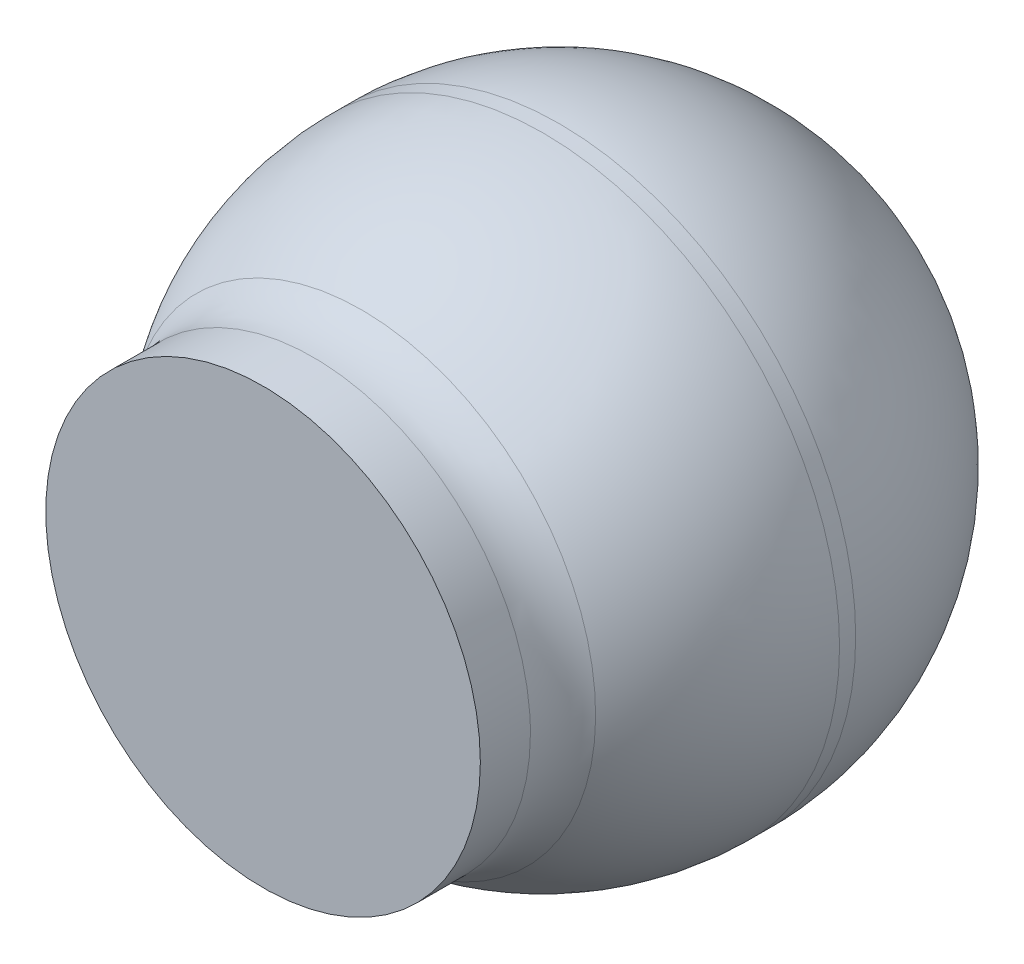
ISO-10303-21;
HEADER;
FILE_DESCRIPTION(('STEP AP214'),'2;1');
FILE_NAME('part.step','',(''),(''),'','','');
FILE_SCHEMA(('AUTOMOTIVE_DESIGN { 1 0 10303 214 1 1 1 1 }'));
ENDSEC;
DATA;
#1=APPLICATION_CONTEXT('core data for automotive mechanical design processes');
#2=APPLICATION_PROTOCOL_DEFINITION('international standard','automotive_design',2000,#1);
#3=PRODUCT_CONTEXT('',#1,'mechanical');
#4=PRODUCT('Part','Part','',(#3));
#5=PRODUCT_RELATED_PRODUCT_CATEGORY('part','',(#4));
#6=PRODUCT_DEFINITION_FORMATION('','',#4);
#7=PRODUCT_DEFINITION_CONTEXT('part definition',#1,'design');
#8=PRODUCT_DEFINITION('design','',#6,#7);
#9=PRODUCT_DEFINITION_SHAPE('','',#8);
#10=(LENGTH_UNIT() NAMED_UNIT(*) SI_UNIT(.MILLI.,.METRE.));
#11=(NAMED_UNIT(*) PLANE_ANGLE_UNIT() SI_UNIT($,.RADIAN.));
#12=(NAMED_UNIT(*) SI_UNIT($,.STERADIAN.) SOLID_ANGLE_UNIT());
#13=UNCERTAINTY_MEASURE_WITH_UNIT(LENGTH_MEASURE(1.E-05),#10,'distance_accuracy_value','');
#14=(GEOMETRIC_REPRESENTATION_CONTEXT(3) GLOBAL_UNCERTAINTY_ASSIGNED_CONTEXT((#13)) GLOBAL_UNIT_ASSIGNED_CONTEXT((#10,
#11,#12)) REPRESENTATION_CONTEXT('',''));
#15=CARTESIAN_POINT('',(0.,0.,0.));
#16=DIRECTION('',(0.,0.,1.));
#17=DIRECTION('',(1.,0.,0.));
#18=AXIS2_PLACEMENT_3D('',#15,#16,#17);
#19=CARTESIAN_POINT('',(-5.642919922269,-11.67134929145,10.006534503384));
#20=DIRECTION('',(0.,0.,-1.));
#21=DIRECTION('',(-1.,0.,0.));
#22=AXIS2_PLACEMENT_3D('',#19,#20,#21);
#23=PLANE('',#22);
#24=CARTESIAN_POINT('',(-5.642919922269,-11.67134929145,10.006534503384));
#25=DIRECTION('',(0.,0.,1.));
#26=DIRECTION('',(1.,0.,0.));
#27=AXIS2_PLACEMENT_3D('',#24,#25,#26);
#28=CIRCLE('',#27,0.275);
#29=CARTESIAN_POINT('',(-5.367919922269,-11.67134929145,10.006534503384));
#30=VERTEX_POINT('',#29);
#31=EDGE_CURVE('E20',#30,#30,#28,.F.);
#32=ORIENTED_EDGE('',*,*,#31,.F.);
#33=EDGE_LOOP('',(#32));
#34=FACE_BOUND('',#33,.T.);
#35=ADVANCED_FACE('F17',(#34),#23,.F.);
#36=CARTESIAN_POINT('',(-5.642919922269,-11.67134929145,9.906534503384));
#37=DIRECTION('',(0.,0.,1.));
#38=DIRECTION('',(1.,0.,0.));
#39=AXIS2_PLACEMENT_3D('',#36,#37,#38);
#40=CYLINDRICAL_SURFACE('',#39,0.275);
#41=CARTESIAN_POINT('',(-5.642919922269,-11.67134929145,9.943180457728));
#42=DIRECTION('',(0.,0.,-1.));
#43=DIRECTION('',(0.996700902337582,0.081162252799247,0.));
#44=AXIS2_PLACEMENT_3D('',#41,#42,#43);
#45=CIRCLE('',#44,0.275);
#46=CARTESIAN_POINT('',(-5.36882717412616,-11.6490296719302,9.943180457728));
#47=VERTEX_POINT('',#46);
#48=EDGE_CURVE('E66',#47,#47,#45,.F.);
#49=ORIENTED_EDGE('',*,*,#48,.T.);
#50=EDGE_LOOP('',(#49));
#51=FACE_BOUND('',#50,.T.);
#52=ORIENTED_EDGE('',*,*,#31,.T.);
#53=EDGE_LOOP('',(#52));
#54=FACE_BOUND('',#53,.T.);
#55=ADVANCED_FACE('F62',(#51,#54),#40,.T.);
#56=CARTESIAN_POINT('',(-5.642919922269,-11.67134929145,9.943180457728));
#57=DIRECTION('',(0.,0.,-1.));
#58=DIRECTION('',(0.996700902337583,0.0811622527992448,0.));
#59=AXIS2_PLACEMENT_3D('',#56,#57,#58);
#60=TOROIDAL_SURFACE('',#59,0.375,0.1);
#61=ORIENTED_EDGE('',*,*,#48,.F.);
#62=EDGE_LOOP('',(#61));
#63=FACE_BOUND('',#62,.T.);
#64=CARTESIAN_POINT('',(-5.642919922269,-11.67134929145,9.881744931236));
#65=DIRECTION('',(0.,0.,-1.));
#66=DIRECTION('',(-0.996700902338691,-0.0811622527856352,0.));
#67=AXIS2_PLACEMENT_3D('',#64,#65,#66);
#68=CIRCLE('',#67,0.296097046412341);
#69=CARTESIAN_POINT('',(-5.938040115608,-11.69538119478,9.881744931236));
#70=VERTEX_POINT('',#69);
#71=EDGE_CURVE('E39',#70,#70,#68,.T.);
#72=ORIENTED_EDGE('',*,*,#71,.F.);
#73=EDGE_LOOP('',(#72));
#74=FACE_BOUND('',#73,.T.);
#75=ADVANCED_FACE('F57',(#63,#74),#60,.F.);
#76=CARTESIAN_POINT('',(-6.016682760645,-11.70178513625,9.651976062157));
#77=CARTESIAN_POINT('',(-6.016682760645,-11.70178513625,9.701461392103));
#78=CARTESIAN_POINT('',(-6.008526217348,-11.70112094157,9.750947004335));
#79=CARTESIAN_POINT('',(-5.992207085349,-11.69979205995,9.798626332798));
#80=CARTESIAN_POINT('',(-5.968341390838,-11.69784865493,9.842699544317));
#81=CARTESIAN_POINT('',(-5.938040115608,-11.69538119478,9.881744931236));
#82=(BOUNDED_CURVE() B_SPLINE_CURVE(5,(#76,#77,#78,#79,#80,#81),.UNSPECIFIED.,.F.,
.F.) B_SPLINE_CURVE_WITH_KNOTS((6,6),(0.,0.661568582165),
.UNSPECIFIED.) CURVE() GEOMETRIC_REPRESENTATION_ITEM() RATIONAL_B_SPLINE_CURVE((1.,1.,1.,1.,1.,1.)) REPRESENTATION_ITEM(''));
#83=CARTESIAN_POINT('',(-5.642919922269,-11.67134929145,9.651976062157));
#84=DIRECTION('',(0.,0.,-1.));
#85=AXIS1_PLACEMENT('',#83,#84);
#86=SURFACE_OF_REVOLUTION('',#82,#85);
#87=CARTESIAN_POINT('',(-5.642919922269,-11.67134929145,9.651976062157));
#88=DIRECTION('',(0.,0.,1.));
#89=DIRECTION('',(1.,0.,0.));
#90=AXIS2_PLACEMENT_3D('',#87,#88,#89);
#91=CIRCLE('',#90,0.375);
#92=CARTESIAN_POINT('',(-5.267919922269,-11.67134929145,9.651976062157));
#93=VERTEX_POINT('',#92);
#94=EDGE_CURVE('E36',#93,#93,#91,.F.);
#95=ORIENTED_EDGE('',*,*,#94,.F.);
#96=EDGE_LOOP('',(#95));
#97=FACE_BOUND('',#96,.T.);
#98=ORIENTED_EDGE('',*,*,#71,.T.);
#99=EDGE_LOOP('',(#98));
#100=FACE_BOUND('',#99,.T.);
#101=ADVANCED_FACE('F53',(#97,#100),#86,.F.);
#102=CARTESIAN_POINT('',(-5.642919922269,-11.67134929145,9.256534503384));
#103=DIRECTION('',(0.,0.,1.));
#104=DIRECTION('',(1.,0.,0.));
#105=AXIS2_PLACEMENT_3D('',#102,#103,#104);
#106=CYLINDRICAL_SURFACE('',#105,0.375);
#107=CARTESIAN_POINT('',(-5.642919922269,-11.67134929145,9.631534503384));
#108=DIRECTION('',(0.,0.,-1.));
#109=DIRECTION('',(0.0811622527992357,-0.996700902337583,0.));
#110=AXIS2_PLACEMENT_3D('',#107,#108,#109);
#111=CIRCLE('',#110,0.375);
#112=CARTESIAN_POINT('',(-5.61248407746929,-12.0451121298266,9.631534503384));
#113=VERTEX_POINT('',#112);
#114=CARTESIAN_POINT('',(-5.67335576706871,-11.2975864530734,9.631534503384));
#115=VERTEX_POINT('',#114);
#116=EDGE_CURVE('E11',#113,#115,#111,.T.);
#117=ORIENTED_EDGE('',*,*,#116,.F.);
#118=CARTESIAN_POINT('',(-5.642919922269,-11.67134929145,9.631534503384));
#119=DIRECTION('',(3.33436315446763E-12,2.72100352061447E-13,1.));
#120=DIRECTION('',(0.0811622527992365,-0.996700902337583,0.));
#121=AXIS2_PLACEMENT_3D('',#118,#119,#120);
#122=CIRCLE('',#121,0.375);
#123=EDGE_CURVE('E25',#115,#113,#122,.F.);
#124=ORIENTED_EDGE('',*,*,#123,.F.);
#125=EDGE_LOOP('',(#117,#124));
#126=FACE_BOUND('',#125,.T.);
#127=ORIENTED_EDGE('',*,*,#94,.T.);
#128=EDGE_LOOP('',(#127));
#129=FACE_BOUND('',#128,.T.);
#130=ADVANCED_FACE('F34',(#126,#129),#106,.T.);
#131=CARTESIAN_POINT('',(-5.642919922269,-11.67134929145,9.631534503384));
#132=DIRECTION('',(0.0811622527992361,-0.996700902337583,0.));
#133=DIRECTION('',(-0.996700902337583,-0.0811622527992361,0.));
#134=AXIS2_PLACEMENT_3D('',#131,#132,#133);
#135=SPHERICAL_SURFACE('',#134,0.375);
#136=ORIENTED_EDGE('',*,*,#123,.T.);
#137=ORIENTED_EDGE('',*,*,#116,.T.);
#138=EDGE_LOOP('',(#136,#137));
#139=FACE_BOUND('',#138,.T.);
#140=ADVANCED_FACE('F32',(#139),#135,.T.);
#141=CLOSED_SHELL('',(#35,#55,#75,#101,#130,#140));
#142=MANIFOLD_SOLID_BREP('B1',#141);
#143=ADVANCED_BREP_SHAPE_REPRESENTATION('',(#18,#142),#14);
#144=SHAPE_DEFINITION_REPRESENTATION(#9,#143);
ENDSEC;
END-ISO-10303-21;
